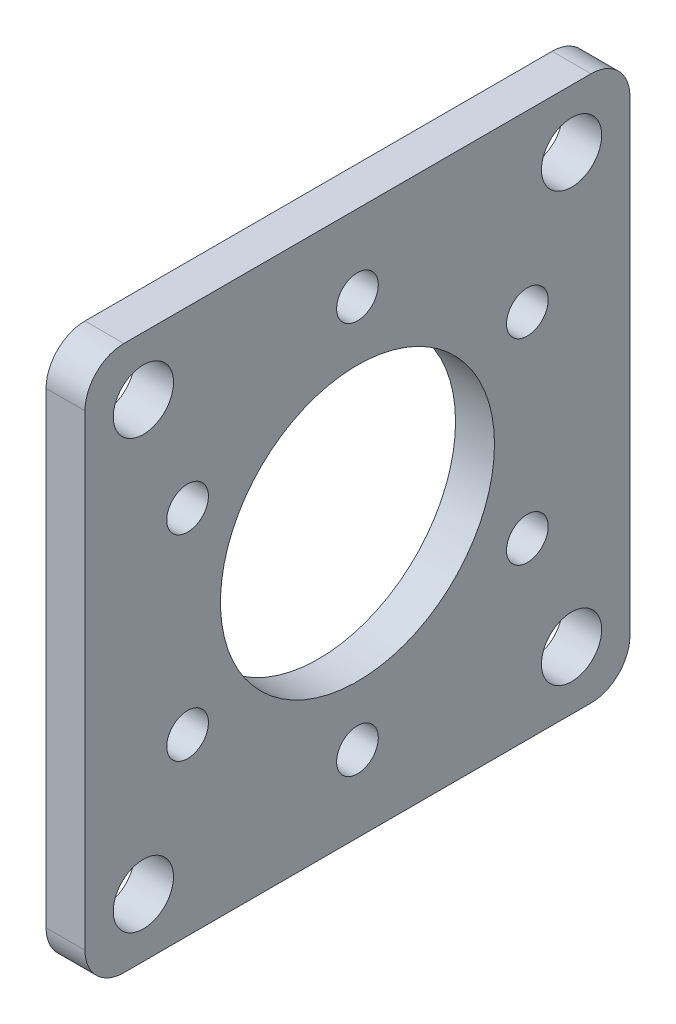
ISO-10303-21;
HEADER;
FILE_DESCRIPTION(('STEP AP214'),'2;1');
FILE_NAME('part.step','',(''),(''),'','','');
FILE_SCHEMA(('AUTOMOTIVE_DESIGN { 1 0 10303 214 1 1 1 1 }'));
ENDSEC;
DATA;
#1=APPLICATION_CONTEXT('core data for automotive mechanical design processes');
#2=APPLICATION_PROTOCOL_DEFINITION('international standard','automotive_design',2000,#1);
#3=PRODUCT_CONTEXT('',#1,'mechanical');
#4=PRODUCT('Part','Part','',(#3));
#5=PRODUCT_RELATED_PRODUCT_CATEGORY('part','',(#4));
#6=PRODUCT_DEFINITION_FORMATION('','',#4);
#7=PRODUCT_DEFINITION_CONTEXT('part definition',#1,'design');
#8=PRODUCT_DEFINITION('design','',#6,#7);
#9=PRODUCT_DEFINITION_SHAPE('','',#8);
#10=(LENGTH_UNIT() NAMED_UNIT(*) SI_UNIT(.MILLI.,.METRE.));
#11=(NAMED_UNIT(*) PLANE_ANGLE_UNIT() SI_UNIT($,.RADIAN.));
#12=(NAMED_UNIT(*) SI_UNIT($,.STERADIAN.) SOLID_ANGLE_UNIT());
#13=UNCERTAINTY_MEASURE_WITH_UNIT(LENGTH_MEASURE(1.E-05),#10,'distance_accuracy_value','');
#14=(GEOMETRIC_REPRESENTATION_CONTEXT(3) GLOBAL_UNCERTAINTY_ASSIGNED_CONTEXT((#13)) GLOBAL_UNIT_ASSIGNED_CONTEXT((#10,
#11,#12)) REPRESENTATION_CONTEXT('',''));
#15=CARTESIAN_POINT('',(0.,0.,0.));
#16=DIRECTION('',(0.,0.,1.));
#17=DIRECTION('',(1.,0.,0.));
#18=AXIS2_PLACEMENT_3D('',#15,#16,#17);
#19=CARTESIAN_POINT('',(3.175,0.,0.));
#20=DIRECTION('',(1.,0.,0.));
#21=DIRECTION('',(0.,0.,-1.));
#22=AXIS2_PLACEMENT_3D('',#19,#20,#21);
#23=PLANE('',#22);
#24=CARTESIAN_POINT('',(3.175,16.,0.));
#25=DIRECTION('',(1.,0.,0.));
#26=DIRECTION('',(0.,0.,-1.));
#27=AXIS2_PLACEMENT_3D('',#24,#25,#26);
#28=CIRCLE('',#27,1.7);
#29=CARTESIAN_POINT('',(3.175,16.,-1.7));
#30=VERTEX_POINT('',#29);
#31=EDGE_CURVE('E300',#30,#30,#28,.T.);
#32=ORIENTED_EDGE('',*,*,#31,.F.);
#33=EDGE_LOOP('',(#32));
#34=FACE_BOUND('',#33,.T.);
#35=CARTESIAN_POINT('',(3.175,8.00000000000145,-13.8564064605519));
#36=DIRECTION('',(1.,0.,0.));
#37=DIRECTION('',(0.,0.,-1.));
#38=AXIS2_PLACEMENT_3D('',#35,#36,#37);
#39=CIRCLE('',#38,1.7);
#40=CARTESIAN_POINT('',(3.175,8.00000000000145,-15.5564064605519));
#41=VERTEX_POINT('',#40);
#42=EDGE_CURVE('E292',#41,#41,#39,.T.);
#43=ORIENTED_EDGE('',*,*,#42,.F.);
#44=EDGE_LOOP('',(#43));
#45=FACE_BOUND('',#44,.T.);
#46=CARTESIAN_POINT('',(3.175,-7.99999999999855,-13.8564064605535));
#47=DIRECTION('',(1.,0.,0.));
#48=DIRECTION('',(0.,0.,-1.));
#49=AXIS2_PLACEMENT_3D('',#46,#47,#48);
#50=CIRCLE('',#49,1.7);
#51=CARTESIAN_POINT('',(3.175,-7.99999999999855,-15.5564064605535));
#52=VERTEX_POINT('',#51);
#53=EDGE_CURVE('E284',#52,#52,#50,.T.);
#54=ORIENTED_EDGE('',*,*,#53,.F.);
#55=EDGE_LOOP('',(#54));
#56=FACE_BOUND('',#55,.T.);
#57=CARTESIAN_POINT('',(3.175,-16.,-3.34338137020771E-12));
#58=DIRECTION('',(1.,0.,0.));
#59=DIRECTION('',(0.,0.,-1.));
#60=AXIS2_PLACEMENT_3D('',#57,#58,#59);
#61=CIRCLE('',#60,1.7);
#62=CARTESIAN_POINT('',(3.175,-16.,-1.70000000000334));
#63=VERTEX_POINT('',#62);
#64=EDGE_CURVE('E276',#63,#63,#61,.T.);
#65=ORIENTED_EDGE('',*,*,#64,.F.);
#66=EDGE_LOOP('',(#65));
#67=FACE_BOUND('',#66,.T.);
#68=CARTESIAN_POINT('',(3.175,-8.00000000000145,13.8564064605485));
#69=DIRECTION('',(1.,0.,0.));
#70=DIRECTION('',(0.,0.,-1.));
#71=AXIS2_PLACEMENT_3D('',#68,#69,#70);
#72=CIRCLE('',#71,1.7);
#73=CARTESIAN_POINT('',(3.175,-8.00000000000145,12.1564064605485));
#74=VERTEX_POINT('',#73);
#75=EDGE_CURVE('E268',#74,#74,#72,.T.);
#76=ORIENTED_EDGE('',*,*,#75,.F.);
#77=EDGE_LOOP('',(#76));
#78=FACE_BOUND('',#77,.T.);
#79=CARTESIAN_POINT('',(3.175,7.99999999999856,13.8564064605502));
#80=DIRECTION('',(1.,0.,0.));
#81=DIRECTION('',(0.,0.,-1.));
#82=AXIS2_PLACEMENT_3D('',#79,#80,#81);
#83=CIRCLE('',#82,1.7);
#84=CARTESIAN_POINT('',(3.175,7.99999999999856,12.1564064605502));
#85=VERTEX_POINT('',#84);
#86=EDGE_CURVE('E260',#85,#85,#83,.T.);
#87=ORIENTED_EDGE('',*,*,#86,.F.);
#88=EDGE_LOOP('',(#87));
#89=FACE_BOUND('',#88,.T.);
#90=CARTESIAN_POINT('',(3.175,17.4625,17.4625));
#91=DIRECTION('',(1.,0.,0.));
#92=DIRECTION('',(0.,0.,-1.));
#93=AXIS2_PLACEMENT_3D('',#90,#91,#92);
#94=CIRCLE('',#93,2.45745);
#95=CARTESIAN_POINT('',(3.175,17.4625,15.00505));
#96=VERTEX_POINT('',#95);
#97=EDGE_CURVE('E252',#96,#96,#94,.T.);
#98=ORIENTED_EDGE('',*,*,#97,.F.);
#99=EDGE_LOOP('',(#98));
#100=FACE_BOUND('',#99,.T.);
#101=CARTESIAN_POINT('',(3.175,17.4625,-17.4625));
#102=DIRECTION('',(1.,0.,0.));
#103=DIRECTION('',(0.,0.,-1.));
#104=AXIS2_PLACEMENT_3D('',#101,#102,#103);
#105=CIRCLE('',#104,2.45745);
#106=CARTESIAN_POINT('',(3.175,17.4625,-19.91995));
#107=VERTEX_POINT('',#106);
#108=EDGE_CURVE('E244',#107,#107,#105,.T.);
#109=ORIENTED_EDGE('',*,*,#108,.F.);
#110=EDGE_LOOP('',(#109));
#111=FACE_BOUND('',#110,.T.);
#112=CARTESIAN_POINT('',(3.175,-17.4625,-17.4625));
#113=DIRECTION('',(1.,0.,0.));
#114=DIRECTION('',(0.,0.,-1.));
#115=AXIS2_PLACEMENT_3D('',#112,#113,#114);
#116=CIRCLE('',#115,2.45745);
#117=CARTESIAN_POINT('',(3.175,-17.4625,-19.91995));
#118=VERTEX_POINT('',#117);
#119=EDGE_CURVE('E236',#118,#118,#116,.T.);
#120=ORIENTED_EDGE('',*,*,#119,.F.);
#121=EDGE_LOOP('',(#120));
#122=FACE_BOUND('',#121,.T.);
#123=CARTESIAN_POINT('',(3.175,-17.4625,17.4625));
#124=DIRECTION('',(1.,0.,0.));
#125=DIRECTION('',(0.,0.,-1.));
#126=AXIS2_PLACEMENT_3D('',#123,#124,#125);
#127=CIRCLE('',#126,2.45745);
#128=CARTESIAN_POINT('',(3.175,-17.4625,15.00505));
#129=VERTEX_POINT('',#128);
#130=EDGE_CURVE('E228',#129,#129,#127,.T.);
#131=ORIENTED_EDGE('',*,*,#130,.F.);
#132=EDGE_LOOP('',(#131));
#133=FACE_BOUND('',#132,.T.);
#134=DIRECTION('',(0.,0.,1.));
#135=VECTOR('',#134,1.);
#136=CARTESIAN_POINT('',(3.175,22.225,-22.225));
#137=LINE('',#136,#135);
#138=CARTESIAN_POINT('',(3.175,22.225,-19.05));
#139=VERTEX_POINT('',#138);
#140=CARTESIAN_POINT('',(3.175,22.225,19.05));
#141=VERTEX_POINT('',#140);
#142=EDGE_CURVE('E158',#139,#141,#137,.T.);
#143=ORIENTED_EDGE('',*,*,#142,.T.);
#144=CARTESIAN_POINT('',(3.175,19.05,19.05));
#145=DIRECTION('',(1.,0.,0.));
#146=DIRECTION('',(0.,0.,-1.));
#147=AXIS2_PLACEMENT_3D('',#144,#145,#146);
#148=CIRCLE('',#147,3.175);
#149=CARTESIAN_POINT('',(3.175,19.05,22.225));
#150=VERTEX_POINT('',#149);
#151=EDGE_CURVE('E188',#141,#150,#148,.T.);
#152=ORIENTED_EDGE('',*,*,#151,.T.);
#153=DIRECTION('',(0.,-1.,0.));
#154=VECTOR('',#153,1.);
#155=CARTESIAN_POINT('',(3.175,-22.225,22.225));
#156=LINE('',#155,#154);
#157=CARTESIAN_POINT('',(3.175,-19.05,22.225));
#158=VERTEX_POINT('',#157);
#159=EDGE_CURVE('E137',#150,#158,#156,.T.);
#160=ORIENTED_EDGE('',*,*,#159,.T.);
#161=CARTESIAN_POINT('',(3.175,-19.05,19.05));
#162=DIRECTION('',(1.,0.,0.));
#163=DIRECTION('',(0.,0.,-1.));
#164=AXIS2_PLACEMENT_3D('',#161,#162,#163);
#165=CIRCLE('',#164,3.175);
#166=CARTESIAN_POINT('',(3.175,-22.225,19.05));
#167=VERTEX_POINT('',#166);
#168=EDGE_CURVE('E180',#158,#167,#165,.T.);
#169=ORIENTED_EDGE('',*,*,#168,.T.);
#170=DIRECTION('',(0.,0.,-1.));
#171=VECTOR('',#170,1.);
#172=CARTESIAN_POINT('',(3.175,-22.225,-22.225));
#173=LINE('',#172,#171);
#174=CARTESIAN_POINT('',(3.175,-22.225,-19.05));
#175=VERTEX_POINT('',#174);
#176=EDGE_CURVE('E203',#167,#175,#173,.T.);
#177=ORIENTED_EDGE('',*,*,#176,.T.);
#178=CARTESIAN_POINT('',(3.175,-19.05,-19.05));
#179=DIRECTION('',(1.,0.,0.));
#180=DIRECTION('',(0.,0.,-1.));
#181=AXIS2_PLACEMENT_3D('',#178,#179,#180);
#182=CIRCLE('',#181,3.175);
#183=CARTESIAN_POINT('',(3.175,-19.05,-22.225));
#184=VERTEX_POINT('',#183);
#185=EDGE_CURVE('E72',#175,#184,#182,.T.);
#186=ORIENTED_EDGE('',*,*,#185,.T.);
#187=DIRECTION('',(0.,1.,0.));
#188=VECTOR('',#187,1.);
#189=CARTESIAN_POINT('',(3.175,-22.225,-22.225));
#190=LINE('',#189,#188);
#191=CARTESIAN_POINT('',(3.175,19.05,-22.225));
#192=VERTEX_POINT('',#191);
#193=EDGE_CURVE('E211',#184,#192,#190,.T.);
#194=ORIENTED_EDGE('',*,*,#193,.T.);
#195=CARTESIAN_POINT('',(3.175,19.05,-19.05));
#196=DIRECTION('',(1.,0.,0.));
#197=DIRECTION('',(0.,0.,-1.));
#198=AXIS2_PLACEMENT_3D('',#195,#196,#197);
#199=CIRCLE('',#198,3.175);
#200=EDGE_CURVE('E185',#192,#139,#199,.T.);
#201=ORIENTED_EDGE('',*,*,#200,.T.);
#202=EDGE_LOOP('',(#143,#152,#160,#169,#177,#186,#194,#201));
#203=FACE_BOUND('',#202,.T.);
#204=CARTESIAN_POINT('',(3.175,0.,0.));
#205=DIRECTION('',(1.,0.,0.));
#206=DIRECTION('',(0.,0.,-1.));
#207=AXIS2_PLACEMENT_3D('',#204,#205,#206);
#208=CIRCLE('',#207,11.176);
#209=CARTESIAN_POINT('',(3.175,0.,-11.176));
#210=VERTEX_POINT('',#209);
#211=EDGE_CURVE('E147',#210,#210,#208,.T.);
#212=ORIENTED_EDGE('',*,*,#211,.F.);
#213=EDGE_LOOP('',(#212));
#214=FACE_BOUND('',#213,.T.);
#215=ADVANCED_FACE('F49',(#34,#45,#56,#67,#78,#89,#100,#111,#122,#133,#203,#214),#23,.T.);
#216=CARTESIAN_POINT('',(0.,0.,0.));
#217=DIRECTION('',(1.,0.,0.));
#218=DIRECTION('',(0.,0.,-1.));
#219=AXIS2_PLACEMENT_3D('',#216,#217,#218);
#220=PLANE('',#219);
#221=CARTESIAN_POINT('',(0.,16.,0.));
#222=DIRECTION('',(1.,0.,0.));
#223=DIRECTION('',(0.,0.,-1.));
#224=AXIS2_PLACEMENT_3D('',#221,#222,#223);
#225=CIRCLE('',#224,1.7);
#226=CARTESIAN_POINT('',(0.,16.,-1.7));
#227=VERTEX_POINT('',#226);
#228=EDGE_CURVE('E296',#227,#227,#225,.T.);
#229=ORIENTED_EDGE('',*,*,#228,.T.);
#230=EDGE_LOOP('',(#229));
#231=FACE_BOUND('',#230,.T.);
#232=CARTESIAN_POINT('',(0.,8.00000000000145,-13.8564064605519));
#233=DIRECTION('',(1.,0.,0.));
#234=DIRECTION('',(0.,0.,-1.));
#235=AXIS2_PLACEMENT_3D('',#232,#233,#234);
#236=CIRCLE('',#235,1.7);
#237=CARTESIAN_POINT('',(0.,8.00000000000145,-15.5564064605519));
#238=VERTEX_POINT('',#237);
#239=EDGE_CURVE('E288',#238,#238,#236,.T.);
#240=ORIENTED_EDGE('',*,*,#239,.T.);
#241=EDGE_LOOP('',(#240));
#242=FACE_BOUND('',#241,.T.);
#243=CARTESIAN_POINT('',(0.,-7.99999999999855,-13.8564064605535));
#244=DIRECTION('',(1.,0.,0.));
#245=DIRECTION('',(0.,0.,-1.));
#246=AXIS2_PLACEMENT_3D('',#243,#244,#245);
#247=CIRCLE('',#246,1.7);
#248=CARTESIAN_POINT('',(0.,-7.99999999999855,-15.5564064605535));
#249=VERTEX_POINT('',#248);
#250=EDGE_CURVE('E280',#249,#249,#247,.T.);
#251=ORIENTED_EDGE('',*,*,#250,.T.);
#252=EDGE_LOOP('',(#251));
#253=FACE_BOUND('',#252,.T.);
#254=CARTESIAN_POINT('',(0.,-16.,-3.34338137020771E-12));
#255=DIRECTION('',(1.,0.,0.));
#256=DIRECTION('',(0.,0.,-1.));
#257=AXIS2_PLACEMENT_3D('',#254,#255,#256);
#258=CIRCLE('',#257,1.7);
#259=CARTESIAN_POINT('',(0.,-16.,-1.70000000000334));
#260=VERTEX_POINT('',#259);
#261=EDGE_CURVE('E272',#260,#260,#258,.T.);
#262=ORIENTED_EDGE('',*,*,#261,.T.);
#263=EDGE_LOOP('',(#262));
#264=FACE_BOUND('',#263,.T.);
#265=CARTESIAN_POINT('',(0.,-8.00000000000145,13.8564064605485));
#266=DIRECTION('',(1.,0.,0.));
#267=DIRECTION('',(0.,0.,-1.));
#268=AXIS2_PLACEMENT_3D('',#265,#266,#267);
#269=CIRCLE('',#268,1.7);
#270=CARTESIAN_POINT('',(0.,-8.00000000000145,12.1564064605485));
#271=VERTEX_POINT('',#270);
#272=EDGE_CURVE('E264',#271,#271,#269,.T.);
#273=ORIENTED_EDGE('',*,*,#272,.T.);
#274=EDGE_LOOP('',(#273));
#275=FACE_BOUND('',#274,.T.);
#276=CARTESIAN_POINT('',(0.,7.99999999999856,13.8564064605502));
#277=DIRECTION('',(1.,0.,0.));
#278=DIRECTION('',(0.,0.,-1.));
#279=AXIS2_PLACEMENT_3D('',#276,#277,#278);
#280=CIRCLE('',#279,1.7);
#281=CARTESIAN_POINT('',(0.,7.99999999999856,12.1564064605502));
#282=VERTEX_POINT('',#281);
#283=EDGE_CURVE('E256',#282,#282,#280,.T.);
#284=ORIENTED_EDGE('',*,*,#283,.T.);
#285=EDGE_LOOP('',(#284));
#286=FACE_BOUND('',#285,.T.);
#287=CARTESIAN_POINT('',(0.,17.4625,17.4625));
#288=DIRECTION('',(1.,0.,0.));
#289=DIRECTION('',(0.,0.,-1.));
#290=AXIS2_PLACEMENT_3D('',#287,#288,#289);
#291=CIRCLE('',#290,2.45745);
#292=CARTESIAN_POINT('',(0.,17.4625,15.00505));
#293=VERTEX_POINT('',#292);
#294=EDGE_CURVE('E248',#293,#293,#291,.T.);
#295=ORIENTED_EDGE('',*,*,#294,.T.);
#296=EDGE_LOOP('',(#295));
#297=FACE_BOUND('',#296,.T.);
#298=CARTESIAN_POINT('',(0.,17.4625,-17.4625));
#299=DIRECTION('',(1.,0.,0.));
#300=DIRECTION('',(0.,0.,-1.));
#301=AXIS2_PLACEMENT_3D('',#298,#299,#300);
#302=CIRCLE('',#301,2.45745);
#303=CARTESIAN_POINT('',(0.,17.4625,-19.91995));
#304=VERTEX_POINT('',#303);
#305=EDGE_CURVE('E240',#304,#304,#302,.T.);
#306=ORIENTED_EDGE('',*,*,#305,.T.);
#307=EDGE_LOOP('',(#306));
#308=FACE_BOUND('',#307,.T.);
#309=CARTESIAN_POINT('',(0.,-17.4625,-17.4625));
#310=DIRECTION('',(1.,0.,0.));
#311=DIRECTION('',(0.,0.,-1.));
#312=AXIS2_PLACEMENT_3D('',#309,#310,#311);
#313=CIRCLE('',#312,2.45745);
#314=CARTESIAN_POINT('',(0.,-17.4625,-19.91995));
#315=VERTEX_POINT('',#314);
#316=EDGE_CURVE('E232',#315,#315,#313,.T.);
#317=ORIENTED_EDGE('',*,*,#316,.T.);
#318=EDGE_LOOP('',(#317));
#319=FACE_BOUND('',#318,.T.);
#320=CARTESIAN_POINT('',(0.,-17.4625,17.4625));
#321=DIRECTION('',(1.,0.,0.));
#322=DIRECTION('',(0.,0.,-1.));
#323=AXIS2_PLACEMENT_3D('',#320,#321,#322);
#324=CIRCLE('',#323,2.45745);
#325=CARTESIAN_POINT('',(0.,-17.4625,15.00505));
#326=VERTEX_POINT('',#325);
#327=EDGE_CURVE('E223',#326,#326,#324,.T.);
#328=ORIENTED_EDGE('',*,*,#327,.T.);
#329=EDGE_LOOP('',(#328));
#330=FACE_BOUND('',#329,.T.);
#331=DIRECTION('',(0.,-1.,0.));
#332=VECTOR('',#331,1.);
#333=CARTESIAN_POINT('',(0.,-22.225,22.225));
#334=LINE('',#333,#332);
#335=CARTESIAN_POINT('',(0.,19.05,22.225));
#336=VERTEX_POINT('',#335);
#337=CARTESIAN_POINT('',(0.,-19.05,22.225));
#338=VERTEX_POINT('',#337);
#339=EDGE_CURVE('E134',#336,#338,#334,.T.);
#340=ORIENTED_EDGE('',*,*,#339,.F.);
#341=CARTESIAN_POINT('',(0.,19.05,19.05));
#342=DIRECTION('',(1.,0.,0.));
#343=DIRECTION('',(0.,0.,-1.));
#344=AXIS2_PLACEMENT_3D('',#341,#342,#343);
#345=CIRCLE('',#344,3.175);
#346=CARTESIAN_POINT('',(0.,22.225,19.05));
#347=VERTEX_POINT('',#346);
#348=EDGE_CURVE('E116',#336,#347,#345,.F.);
#349=ORIENTED_EDGE('',*,*,#348,.T.);
#350=DIRECTION('',(0.,0.,1.));
#351=VECTOR('',#350,1.);
#352=CARTESIAN_POINT('',(0.,22.225,-22.225));
#353=LINE('',#352,#351);
#354=CARTESIAN_POINT('',(0.,22.225,-19.05));
#355=VERTEX_POINT('',#354);
#356=EDGE_CURVE('E163',#355,#347,#353,.T.);
#357=ORIENTED_EDGE('',*,*,#356,.F.);
#358=CARTESIAN_POINT('',(0.,19.05,-19.05));
#359=DIRECTION('',(1.,0.,0.));
#360=DIRECTION('',(0.,0.,-1.));
#361=AXIS2_PLACEMENT_3D('',#358,#359,#360);
#362=CIRCLE('',#361,3.175);
#363=CARTESIAN_POINT('',(0.,19.05,-22.225));
#364=VERTEX_POINT('',#363);
#365=EDGE_CURVE('E128',#355,#364,#362,.F.);
#366=ORIENTED_EDGE('',*,*,#365,.T.);
#367=DIRECTION('',(0.,1.,0.));
#368=VECTOR('',#367,1.);
#369=CARTESIAN_POINT('',(0.,-22.225,-22.225));
#370=LINE('',#369,#368);
#371=CARTESIAN_POINT('',(0.,-19.05,-22.225));
#372=VERTEX_POINT('',#371);
#373=EDGE_CURVE('E152',#372,#364,#370,.T.);
#374=ORIENTED_EDGE('',*,*,#373,.F.);
#375=CARTESIAN_POINT('',(0.,-19.05,-19.05));
#376=DIRECTION('',(1.,0.,0.));
#377=DIRECTION('',(0.,0.,-1.));
#378=AXIS2_PLACEMENT_3D('',#375,#376,#377);
#379=CIRCLE('',#378,3.175);
#380=CARTESIAN_POINT('',(0.,-22.225,-19.05));
#381=VERTEX_POINT('',#380);
#382=EDGE_CURVE('E170',#372,#381,#379,.F.);
#383=ORIENTED_EDGE('',*,*,#382,.T.);
#384=DIRECTION('',(0.,0.,-1.));
#385=VECTOR('',#384,1.);
#386=CARTESIAN_POINT('',(0.,-22.225,-22.225));
#387=LINE('',#386,#385);
#388=CARTESIAN_POINT('',(0.,-22.225,19.05));
#389=VERTEX_POINT('',#388);
#390=EDGE_CURVE('E146',#389,#381,#387,.T.);
#391=ORIENTED_EDGE('',*,*,#390,.F.);
#392=CARTESIAN_POINT('',(0.,-19.05,19.05));
#393=DIRECTION('',(1.,0.,0.));
#394=DIRECTION('',(0.,0.,-1.));
#395=AXIS2_PLACEMENT_3D('',#392,#393,#394);
#396=CIRCLE('',#395,3.175);
#397=EDGE_CURVE('E139',#389,#338,#396,.F.);
#398=ORIENTED_EDGE('',*,*,#397,.T.);
#399=EDGE_LOOP('',(#340,#349,#357,#366,#374,#383,#391,#398));
#400=FACE_BOUND('',#399,.T.);
#401=CARTESIAN_POINT('',(0.,0.,0.));
#402=DIRECTION('',(1.,0.,0.));
#403=DIRECTION('',(0.,0.,-1.));
#404=AXIS2_PLACEMENT_3D('',#401,#402,#403);
#405=CIRCLE('',#404,11.176);
#406=CARTESIAN_POINT('',(0.,0.,-11.176));
#407=VERTEX_POINT('',#406);
#408=EDGE_CURVE('E155',#407,#407,#405,.T.);
#409=ORIENTED_EDGE('',*,*,#408,.T.);
#410=EDGE_LOOP('',(#409));
#411=FACE_BOUND('',#410,.T.);
#412=ADVANCED_FACE('F142',(#231,#242,#253,#264,#275,#286,#297,#308,#319,#330,#400,#411),#220,.F.);
#413=CARTESIAN_POINT('',(3.175,-22.225,22.225));
#414=DIRECTION('',(0.,0.,-1.));
#415=DIRECTION('',(-1.,0.,0.));
#416=AXIS2_PLACEMENT_3D('',#413,#414,#415);
#417=PLANE('',#416);
#418=ORIENTED_EDGE('',*,*,#159,.F.);
#419=DIRECTION('',(-1.,0.,0.));
#420=VECTOR('',#419,1.);
#421=CARTESIAN_POINT('',(3.175,19.05,22.225));
#422=LINE('',#421,#420);
#423=EDGE_CURVE('E120',#150,#336,#422,.T.);
#424=ORIENTED_EDGE('',*,*,#423,.T.);
#425=ORIENTED_EDGE('',*,*,#339,.T.);
#426=DIRECTION('',(-1.,0.,0.));
#427=VECTOR('',#426,1.);
#428=CARTESIAN_POINT('',(3.175,-19.05,22.225));
#429=LINE('',#428,#427);
#430=EDGE_CURVE('E140',#338,#158,#429,.F.);
#431=ORIENTED_EDGE('',*,*,#430,.T.);
#432=EDGE_LOOP('',(#418,#424,#425,#431));
#433=FACE_BOUND('',#432,.T.);
#434=ADVANCED_FACE('F133',(#433),#417,.F.);
#435=CARTESIAN_POINT('',(3.175,-22.225,-22.225));
#436=DIRECTION('',(0.,1.,0.));
#437=DIRECTION('',(0.,0.,1.));
#438=AXIS2_PLACEMENT_3D('',#435,#436,#437);
#439=PLANE('',#438);
#440=ORIENTED_EDGE('',*,*,#390,.T.);
#441=DIRECTION('',(-1.,0.,0.));
#442=VECTOR('',#441,1.);
#443=CARTESIAN_POINT('',(3.175,-22.225,-19.05));
#444=LINE('',#443,#442);
#445=EDGE_CURVE('E11',#381,#175,#444,.F.);
#446=ORIENTED_EDGE('',*,*,#445,.T.);
#447=ORIENTED_EDGE('',*,*,#176,.F.);
#448=DIRECTION('',(-1.,0.,0.));
#449=VECTOR('',#448,1.);
#450=CARTESIAN_POINT('',(3.175,-22.225,19.05));
#451=LINE('',#450,#449);
#452=EDGE_CURVE('E58',#167,#389,#451,.T.);
#453=ORIENTED_EDGE('',*,*,#452,.T.);
#454=EDGE_LOOP('',(#440,#446,#447,#453));
#455=FACE_BOUND('',#454,.T.);
#456=ADVANCED_FACE('F201',(#455),#439,.F.);
#457=CARTESIAN_POINT('',(3.175,-22.225,-22.225));
#458=DIRECTION('',(0.,0.,1.));
#459=DIRECTION('',(1.,0.,0.));
#460=AXIS2_PLACEMENT_3D('',#457,#458,#459);
#461=PLANE('',#460);
#462=ORIENTED_EDGE('',*,*,#373,.T.);
#463=DIRECTION('',(-1.,0.,0.));
#464=VECTOR('',#463,1.);
#465=CARTESIAN_POINT('',(3.175,19.05,-22.225));
#466=LINE('',#465,#464);
#467=EDGE_CURVE('E65',#364,#192,#466,.F.);
#468=ORIENTED_EDGE('',*,*,#467,.T.);
#469=ORIENTED_EDGE('',*,*,#193,.F.);
#470=DIRECTION('',(-1.,0.,0.));
#471=VECTOR('',#470,1.);
#472=CARTESIAN_POINT('',(3.175,-19.05,-22.225));
#473=LINE('',#472,#471);
#474=EDGE_CURVE('E191',#184,#372,#473,.T.);
#475=ORIENTED_EDGE('',*,*,#474,.T.);
#476=EDGE_LOOP('',(#462,#468,#469,#475));
#477=FACE_BOUND('',#476,.T.);
#478=ADVANCED_FACE('F210',(#477),#461,.F.);
#479=CARTESIAN_POINT('',(3.175,22.225,-22.225));
#480=DIRECTION('',(0.,-1.,0.));
#481=DIRECTION('',(0.,0.,-1.));
#482=AXIS2_PLACEMENT_3D('',#479,#480,#481);
#483=PLANE('',#482);
#484=ORIENTED_EDGE('',*,*,#356,.T.);
#485=DIRECTION('',(-1.,0.,0.));
#486=VECTOR('',#485,1.);
#487=CARTESIAN_POINT('',(3.175,22.225,19.05));
#488=LINE('',#487,#486);
#489=EDGE_CURVE('E121',#347,#141,#488,.F.);
#490=ORIENTED_EDGE('',*,*,#489,.T.);
#491=ORIENTED_EDGE('',*,*,#142,.F.);
#492=DIRECTION('',(-1.,0.,0.));
#493=VECTOR('',#492,1.);
#494=CARTESIAN_POINT('',(3.175,22.225,-19.05));
#495=LINE('',#494,#493);
#496=EDGE_CURVE('E127',#139,#355,#495,.T.);
#497=ORIENTED_EDGE('',*,*,#496,.T.);
#498=EDGE_LOOP('',(#484,#490,#491,#497));
#499=FACE_BOUND('',#498,.T.);
#500=ADVANCED_FACE('F335',(#499),#483,.F.);
#501=CARTESIAN_POINT('',(3.175,0.,0.));
#502=DIRECTION('',(-1.,0.,0.));
#503=DIRECTION('',(0.,0.,1.));
#504=AXIS2_PLACEMENT_3D('',#501,#502,#503);
#505=CYLINDRICAL_SURFACE('',#504,11.176);
#506=ORIENTED_EDGE('',*,*,#211,.T.);
#507=EDGE_LOOP('',(#506));
#508=FACE_BOUND('',#507,.T.);
#509=ORIENTED_EDGE('',*,*,#408,.F.);
#510=EDGE_LOOP('',(#509));
#511=FACE_BOUND('',#510,.T.);
#512=ADVANCED_FACE('F331',(#508,#511),#505,.F.);
#513=CARTESIAN_POINT('',(3.175,-17.4625,17.4625));
#514=DIRECTION('',(1.,0.,0.));
#515=DIRECTION('',(0.,0.,-1.));
#516=AXIS2_PLACEMENT_3D('',#513,#514,#515);
#517=CYLINDRICAL_SURFACE('',#516,2.45745);
#518=ORIENTED_EDGE('',*,*,#327,.F.);
#519=EDGE_LOOP('',(#518));
#520=FACE_BOUND('',#519,.T.);
#521=ORIENTED_EDGE('',*,*,#130,.T.);
#522=EDGE_LOOP('',(#521));
#523=FACE_BOUND('',#522,.T.);
#524=ADVANCED_FACE('F334',(#520,#523),#517,.F.);
#525=CARTESIAN_POINT('',(3.175,-17.4625,-17.4625));
#526=DIRECTION('',(1.,0.,0.));
#527=DIRECTION('',(0.,0.,-1.));
#528=AXIS2_PLACEMENT_3D('',#525,#526,#527);
#529=CYLINDRICAL_SURFACE('',#528,2.45745);
#530=ORIENTED_EDGE('',*,*,#316,.F.);
#531=EDGE_LOOP('',(#530));
#532=FACE_BOUND('',#531,.T.);
#533=ORIENTED_EDGE('',*,*,#119,.T.);
#534=EDGE_LOOP('',(#533));
#535=FACE_BOUND('',#534,.T.);
#536=ADVANCED_FACE('F487',(#532,#535),#529,.F.);
#537=CARTESIAN_POINT('',(3.175,17.4625,-17.4625));
#538=DIRECTION('',(1.,0.,0.));
#539=DIRECTION('',(0.,0.,-1.));
#540=AXIS2_PLACEMENT_3D('',#537,#538,#539);
#541=CYLINDRICAL_SURFACE('',#540,2.45745);
#542=ORIENTED_EDGE('',*,*,#305,.F.);
#543=EDGE_LOOP('',(#542));
#544=FACE_BOUND('',#543,.T.);
#545=ORIENTED_EDGE('',*,*,#108,.T.);
#546=EDGE_LOOP('',(#545));
#547=FACE_BOUND('',#546,.T.);
#548=ADVANCED_FACE('F478',(#544,#547),#541,.F.);
#549=CARTESIAN_POINT('',(3.175,17.4625,17.4625));
#550=DIRECTION('',(1.,0.,0.));
#551=DIRECTION('',(0.,0.,-1.));
#552=AXIS2_PLACEMENT_3D('',#549,#550,#551);
#553=CYLINDRICAL_SURFACE('',#552,2.45745);
#554=ORIENTED_EDGE('',*,*,#294,.F.);
#555=EDGE_LOOP('',(#554));
#556=FACE_BOUND('',#555,.T.);
#557=ORIENTED_EDGE('',*,*,#97,.T.);
#558=EDGE_LOOP('',(#557));
#559=FACE_BOUND('',#558,.T.);
#560=ADVANCED_FACE('F469',(#556,#559),#553,.F.);
#561=CARTESIAN_POINT('',(3.175,7.99999999999856,13.8564064605502));
#562=DIRECTION('',(1.,0.,0.));
#563=DIRECTION('',(0.,0.,-1.));
#564=AXIS2_PLACEMENT_3D('',#561,#562,#563);
#565=CYLINDRICAL_SURFACE('',#564,1.7);
#566=ORIENTED_EDGE('',*,*,#283,.F.);
#567=EDGE_LOOP('',(#566));
#568=FACE_BOUND('',#567,.T.);
#569=ORIENTED_EDGE('',*,*,#86,.T.);
#570=EDGE_LOOP('',(#569));
#571=FACE_BOUND('',#570,.T.);
#572=ADVANCED_FACE('F460',(#568,#571),#565,.F.);
#573=CARTESIAN_POINT('',(3.175,-8.00000000000145,13.8564064605485));
#574=DIRECTION('',(1.,0.,0.));
#575=DIRECTION('',(0.,0.,-1.));
#576=AXIS2_PLACEMENT_3D('',#573,#574,#575);
#577=CYLINDRICAL_SURFACE('',#576,1.7);
#578=ORIENTED_EDGE('',*,*,#272,.F.);
#579=EDGE_LOOP('',(#578));
#580=FACE_BOUND('',#579,.T.);
#581=ORIENTED_EDGE('',*,*,#75,.T.);
#582=EDGE_LOOP('',(#581));
#583=FACE_BOUND('',#582,.T.);
#584=ADVANCED_FACE('F451',(#580,#583),#577,.F.);
#585=CARTESIAN_POINT('',(3.175,-16.,-3.34338137020771E-12));
#586=DIRECTION('',(1.,0.,0.));
#587=DIRECTION('',(0.,0.,-1.));
#588=AXIS2_PLACEMENT_3D('',#585,#586,#587);
#589=CYLINDRICAL_SURFACE('',#588,1.7);
#590=ORIENTED_EDGE('',*,*,#261,.F.);
#591=EDGE_LOOP('',(#590));
#592=FACE_BOUND('',#591,.T.);
#593=ORIENTED_EDGE('',*,*,#64,.T.);
#594=EDGE_LOOP('',(#593));
#595=FACE_BOUND('',#594,.T.);
#596=ADVANCED_FACE('F442',(#592,#595),#589,.F.);
#597=CARTESIAN_POINT('',(3.175,-7.99999999999855,-13.8564064605535));
#598=DIRECTION('',(1.,0.,0.));
#599=DIRECTION('',(0.,0.,-1.));
#600=AXIS2_PLACEMENT_3D('',#597,#598,#599);
#601=CYLINDRICAL_SURFACE('',#600,1.7);
#602=ORIENTED_EDGE('',*,*,#250,.F.);
#603=EDGE_LOOP('',(#602));
#604=FACE_BOUND('',#603,.T.);
#605=ORIENTED_EDGE('',*,*,#53,.T.);
#606=EDGE_LOOP('',(#605));
#607=FACE_BOUND('',#606,.T.);
#608=ADVANCED_FACE('F433',(#604,#607),#601,.F.);
#609=CARTESIAN_POINT('',(3.175,8.00000000000145,-13.8564064605519));
#610=DIRECTION('',(1.,0.,0.));
#611=DIRECTION('',(0.,0.,-1.));
#612=AXIS2_PLACEMENT_3D('',#609,#610,#611);
#613=CYLINDRICAL_SURFACE('',#612,1.7);
#614=ORIENTED_EDGE('',*,*,#239,.F.);
#615=EDGE_LOOP('',(#614));
#616=FACE_BOUND('',#615,.T.);
#617=ORIENTED_EDGE('',*,*,#42,.T.);
#618=EDGE_LOOP('',(#617));
#619=FACE_BOUND('',#618,.T.);
#620=ADVANCED_FACE('F424',(#616,#619),#613,.F.);
#621=CARTESIAN_POINT('',(3.175,16.,0.));
#622=DIRECTION('',(1.,0.,0.));
#623=DIRECTION('',(0.,0.,-1.));
#624=AXIS2_PLACEMENT_3D('',#621,#622,#623);
#625=CYLINDRICAL_SURFACE('',#624,1.7);
#626=ORIENTED_EDGE('',*,*,#228,.F.);
#627=EDGE_LOOP('',(#626));
#628=FACE_BOUND('',#627,.T.);
#629=ORIENTED_EDGE('',*,*,#31,.T.);
#630=EDGE_LOOP('',(#629));
#631=FACE_BOUND('',#630,.T.);
#632=ADVANCED_FACE('F305',(#628,#631),#625,.F.);
#633=CARTESIAN_POINT('',(3.175,19.05,19.05));
#634=DIRECTION('',(-1.,0.,0.));
#635=DIRECTION('',(0.,0.,1.));
#636=AXIS2_PLACEMENT_3D('',#633,#634,#635);
#637=CYLINDRICAL_SURFACE('',#636,3.175);
#638=ORIENTED_EDGE('',*,*,#151,.F.);
#639=ORIENTED_EDGE('',*,*,#489,.F.);
#640=ORIENTED_EDGE('',*,*,#348,.F.);
#641=ORIENTED_EDGE('',*,*,#423,.F.);
#642=EDGE_LOOP('',(#638,#639,#640,#641));
#643=FACE_BOUND('',#642,.T.);
#644=ADVANCED_FACE('F119',(#643),#637,.T.);
#645=CARTESIAN_POINT('',(3.175,19.05,-19.05));
#646=DIRECTION('',(-1.,0.,0.));
#647=DIRECTION('',(0.,0.,1.));
#648=AXIS2_PLACEMENT_3D('',#645,#646,#647);
#649=CYLINDRICAL_SURFACE('',#648,3.175);
#650=ORIENTED_EDGE('',*,*,#200,.F.);
#651=ORIENTED_EDGE('',*,*,#467,.F.);
#652=ORIENTED_EDGE('',*,*,#365,.F.);
#653=ORIENTED_EDGE('',*,*,#496,.F.);
#654=EDGE_LOOP('',(#650,#651,#652,#653));
#655=FACE_BOUND('',#654,.T.);
#656=ADVANCED_FACE('F356',(#655),#649,.T.);
#657=CARTESIAN_POINT('',(3.175,-19.05,-19.05));
#658=DIRECTION('',(-1.,0.,0.));
#659=DIRECTION('',(0.,0.,1.));
#660=AXIS2_PLACEMENT_3D('',#657,#658,#659);
#661=CYLINDRICAL_SURFACE('',#660,3.175);
#662=ORIENTED_EDGE('',*,*,#185,.F.);
#663=ORIENTED_EDGE('',*,*,#445,.F.);
#664=ORIENTED_EDGE('',*,*,#382,.F.);
#665=ORIENTED_EDGE('',*,*,#474,.F.);
#666=EDGE_LOOP('',(#662,#663,#664,#665));
#667=FACE_BOUND('',#666,.T.);
#668=ADVANCED_FACE('F209',(#667),#661,.T.);
#669=CARTESIAN_POINT('',(3.175,-19.05,19.05));
#670=DIRECTION('',(-1.,0.,0.));
#671=DIRECTION('',(0.,0.,1.));
#672=AXIS2_PLACEMENT_3D('',#669,#670,#671);
#673=CYLINDRICAL_SURFACE('',#672,3.175);
#674=ORIENTED_EDGE('',*,*,#168,.F.);
#675=ORIENTED_EDGE('',*,*,#430,.F.);
#676=ORIENTED_EDGE('',*,*,#397,.F.);
#677=ORIENTED_EDGE('',*,*,#452,.F.);
#678=EDGE_LOOP('',(#674,#675,#676,#677));
#679=FACE_BOUND('',#678,.T.);
#680=ADVANCED_FACE('F51',(#679),#673,.T.);
#681=CLOSED_SHELL('',(#215,#412,#434,#456,#478,#500,#512,#524,#536,#548,#560,#572,#584,#596,
#608,#620,#632,#644,#656,#668,#680));
#682=MANIFOLD_SOLID_BREP('B2',#681);
#683=ADVANCED_BREP_SHAPE_REPRESENTATION('',(#18,#682),#14);
#684=SHAPE_DEFINITION_REPRESENTATION(#9,#683);
ENDSEC;
END-ISO-10303-21;
